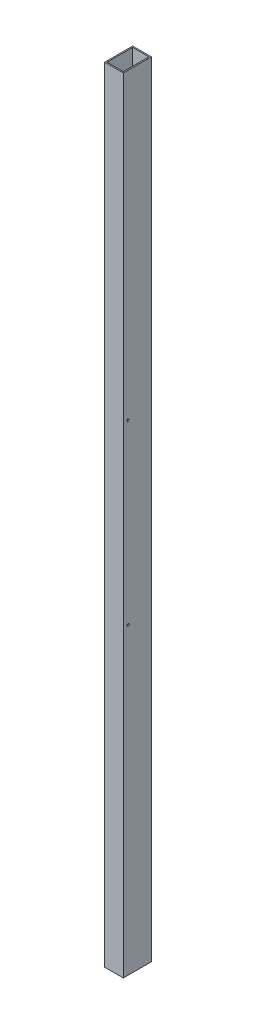
ISO-10303-21;
HEADER;
FILE_DESCRIPTION(('STEP AP214'),'2;1');
FILE_NAME('part.step','',(''),(''),'','','');
FILE_SCHEMA(('AUTOMOTIVE_DESIGN { 1 0 10303 214 1 1 1 1 }'));
ENDSEC;
DATA;
#1=APPLICATION_CONTEXT('core data for automotive mechanical design processes');
#2=APPLICATION_PROTOCOL_DEFINITION('international standard','automotive_design',2000,#1);
#3=PRODUCT_CONTEXT('',#1,'mechanical');
#4=PRODUCT('Part','Part','',(#3));
#5=PRODUCT_RELATED_PRODUCT_CATEGORY('part','',(#4));
#6=PRODUCT_DEFINITION_FORMATION('','',#4);
#7=PRODUCT_DEFINITION_CONTEXT('part definition',#1,'design');
#8=PRODUCT_DEFINITION('design','',#6,#7);
#9=PRODUCT_DEFINITION_SHAPE('','',#8);
#10=(LENGTH_UNIT() NAMED_UNIT(*) SI_UNIT(.MILLI.,.METRE.));
#11=(NAMED_UNIT(*) PLANE_ANGLE_UNIT() SI_UNIT($,.RADIAN.));
#12=(NAMED_UNIT(*) SI_UNIT($,.STERADIAN.) SOLID_ANGLE_UNIT());
#13=UNCERTAINTY_MEASURE_WITH_UNIT(LENGTH_MEASURE(1.E-05),#10,'distance_accuracy_value','');
#14=(GEOMETRIC_REPRESENTATION_CONTEXT(3) GLOBAL_UNCERTAINTY_ASSIGNED_CONTEXT((#13)) GLOBAL_UNIT_ASSIGNED_CONTEXT((#10,
#11,#12)) REPRESENTATION_CONTEXT('',''));
#15=CARTESIAN_POINT('',(0.,0.,0.));
#16=DIRECTION('',(0.,0.,1.));
#17=DIRECTION('',(1.,0.,0.));
#18=AXIS2_PLACEMENT_3D('',#15,#16,#17);
#19=CARTESIAN_POINT('',(0.,-1066.8,0.));
#20=DIRECTION('',(0.,-1.,0.));
#21=DIRECTION('',(1.,0.,0.));
#22=AXIS2_PLACEMENT_3D('',#19,#20,#21);
#23=PLANE('',#22);
#24=DIRECTION('',(0.,0.,-1.));
#25=VECTOR('',#24,1.);
#26=CARTESIAN_POINT('',(25.4,-1066.8,0.));
#27=LINE('',#26,#25);
#28=CARTESIAN_POINT('',(25.4,-1066.8,38.1));
#29=VERTEX_POINT('',#28);
#30=CARTESIAN_POINT('',(25.4,-1066.8,-38.1));
#31=VERTEX_POINT('',#30);
#32=EDGE_CURVE('E145',#29,#31,#27,.T.);
#33=ORIENTED_EDGE('',*,*,#32,.F.);
#34=DIRECTION('',(-1.,0.,0.));
#35=VECTOR('',#34,1.);
#36=CARTESIAN_POINT('',(0.,-1066.8,38.1));
#37=LINE('',#36,#35);
#38=CARTESIAN_POINT('',(-25.4,-1066.8,38.1));
#39=VERTEX_POINT('',#38);
#40=EDGE_CURVE('E149',#29,#39,#37,.T.);
#41=ORIENTED_EDGE('',*,*,#40,.T.);
#42=DIRECTION('',(0.,0.,-1.));
#43=VECTOR('',#42,1.);
#44=CARTESIAN_POINT('',(-25.4,-1066.8,0.));
#45=LINE('',#44,#43);
#46=CARTESIAN_POINT('',(-25.4,-1066.8,-38.1));
#47=VERTEX_POINT('',#46);
#48=EDGE_CURVE('E153',#39,#47,#45,.T.);
#49=ORIENTED_EDGE('',*,*,#48,.T.);
#50=DIRECTION('',(-1.,0.,0.));
#51=VECTOR('',#50,1.);
#52=CARTESIAN_POINT('',(0.,-1066.8,-38.1));
#53=LINE('',#52,#51);
#54=EDGE_CURVE('E156',#31,#47,#53,.T.);
#55=ORIENTED_EDGE('',*,*,#54,.F.);
#56=EDGE_LOOP('',(#33,#41,#49,#55));
#57=FACE_BOUND('',#56,.T.);
#58=DIRECTION('',(-1.,0.,0.));
#59=VECTOR('',#58,1.);
#60=CARTESIAN_POINT('',(0.,-1066.8,34.925));
#61=LINE('',#60,#59);
#62=CARTESIAN_POINT('',(22.225,-1066.8,34.925));
#63=VERTEX_POINT('',#62);
#64=CARTESIAN_POINT('',(-22.225,-1066.8,34.925));
#65=VERTEX_POINT('',#64);
#66=EDGE_CURVE('E132',#63,#65,#61,.T.);
#67=ORIENTED_EDGE('',*,*,#66,.F.);
#68=DIRECTION('',(0.,0.,-1.));
#69=VECTOR('',#68,1.);
#70=CARTESIAN_POINT('',(22.225,-1066.8,0.));
#71=LINE('',#70,#69);
#72=CARTESIAN_POINT('',(22.225,-1066.8,-34.925));
#73=VERTEX_POINT('',#72);
#74=EDGE_CURVE('E126',#63,#73,#71,.T.);
#75=ORIENTED_EDGE('',*,*,#74,.T.);
#76=DIRECTION('',(-1.,0.,0.));
#77=VECTOR('',#76,1.);
#78=CARTESIAN_POINT('',(0.,-1066.8,-34.925));
#79=LINE('',#78,#77);
#80=CARTESIAN_POINT('',(-22.225,-1066.8,-34.925));
#81=VERTEX_POINT('',#80);
#82=EDGE_CURVE('E107',#73,#81,#79,.T.);
#83=ORIENTED_EDGE('',*,*,#82,.T.);
#84=DIRECTION('',(0.,0.,-1.));
#85=VECTOR('',#84,1.);
#86=CARTESIAN_POINT('',(-22.225,-1066.8,0.));
#87=LINE('',#86,#85);
#88=EDGE_CURVE('E141',#65,#81,#87,.T.);
#89=ORIENTED_EDGE('',*,*,#88,.F.);
#90=EDGE_LOOP('',(#67,#75,#83,#89));
#91=FACE_BOUND('',#90,.T.);
#92=ADVANCED_FACE('F14',(#57,#91),#23,.T.);
#93=CARTESIAN_POINT('',(0.,1066.8,0.));
#94=DIRECTION('',(0.,-1.,0.));
#95=DIRECTION('',(1.,0.,0.));
#96=AXIS2_PLACEMENT_3D('',#93,#94,#95);
#97=PLANE('',#96);
#98=DIRECTION('',(0.,0.,-1.));
#99=VECTOR('',#98,1.);
#100=CARTESIAN_POINT('',(25.4,1066.8,0.));
#101=LINE('',#100,#99);
#102=CARTESIAN_POINT('',(25.4,1066.8,38.1));
#103=VERTEX_POINT('',#102);
#104=CARTESIAN_POINT('',(25.4,1066.8,-38.1));
#105=VERTEX_POINT('',#104);
#106=EDGE_CURVE('E161',#103,#105,#101,.T.);
#107=ORIENTED_EDGE('',*,*,#106,.T.);
#108=DIRECTION('',(-1.,0.,0.));
#109=VECTOR('',#108,1.);
#110=CARTESIAN_POINT('',(0.,1066.8,-38.1));
#111=LINE('',#110,#109);
#112=CARTESIAN_POINT('',(-25.4,1066.8,-38.1));
#113=VERTEX_POINT('',#112);
#114=EDGE_CURVE('E150',#105,#113,#111,.T.);
#115=ORIENTED_EDGE('',*,*,#114,.T.);
#116=DIRECTION('',(0.,0.,-1.));
#117=VECTOR('',#116,1.);
#118=CARTESIAN_POINT('',(-25.4,1066.8,0.));
#119=LINE('',#118,#117);
#120=CARTESIAN_POINT('',(-25.4,1066.8,38.1));
#121=VERTEX_POINT('',#120);
#122=EDGE_CURVE('E168',#121,#113,#119,.T.);
#123=ORIENTED_EDGE('',*,*,#122,.F.);
#124=DIRECTION('',(-1.,0.,0.));
#125=VECTOR('',#124,1.);
#126=CARTESIAN_POINT('',(0.,1066.8,38.1));
#127=LINE('',#126,#125);
#128=EDGE_CURVE('E165',#103,#121,#127,.T.);
#129=ORIENTED_EDGE('',*,*,#128,.F.);
#130=EDGE_LOOP('',(#107,#115,#123,#129));
#131=FACE_BOUND('',#130,.T.);
#132=DIRECTION('',(0.,0.,-1.));
#133=VECTOR('',#132,1.);
#134=CARTESIAN_POINT('',(22.225,1066.8,0.));
#135=LINE('',#134,#133);
#136=CARTESIAN_POINT('',(22.225,1066.8,34.925));
#137=VERTEX_POINT('',#136);
#138=CARTESIAN_POINT('',(22.225,1066.8,-34.925));
#139=VERTEX_POINT('',#138);
#140=EDGE_CURVE('E114',#137,#139,#135,.T.);
#141=ORIENTED_EDGE('',*,*,#140,.F.);
#142=DIRECTION('',(-1.,0.,0.));
#143=VECTOR('',#142,1.);
#144=CARTESIAN_POINT('',(0.,1066.8,34.925));
#145=LINE('',#144,#143);
#146=CARTESIAN_POINT('',(-22.225,1066.8,34.925));
#147=VERTEX_POINT('',#146);
#148=EDGE_CURVE('E121',#137,#147,#145,.T.);
#149=ORIENTED_EDGE('',*,*,#148,.T.);
#150=DIRECTION('',(0.,0.,-1.));
#151=VECTOR('',#150,1.);
#152=CARTESIAN_POINT('',(-22.225,1066.8,0.));
#153=LINE('',#152,#151);
#154=CARTESIAN_POINT('',(-22.225,1066.8,-34.925));
#155=VERTEX_POINT('',#154);
#156=EDGE_CURVE('E48',#147,#155,#153,.T.);
#157=ORIENTED_EDGE('',*,*,#156,.T.);
#158=DIRECTION('',(-1.,0.,0.));
#159=VECTOR('',#158,1.);
#160=CARTESIAN_POINT('',(0.,1066.8,-34.925));
#161=LINE('',#160,#159);
#162=EDGE_CURVE('E105',#139,#155,#161,.T.);
#163=ORIENTED_EDGE('',*,*,#162,.F.);
#164=EDGE_LOOP('',(#141,#149,#157,#163));
#165=FACE_BOUND('',#164,.T.);
#166=ADVANCED_FACE('F124',(#131,#165),#97,.F.);
#167=CARTESIAN_POINT('',(25.4,-1066.8,0.));
#168=DIRECTION('',(1.,0.,0.));
#169=DIRECTION('',(0.,0.,-1.));
#170=AXIS2_PLACEMENT_3D('',#167,#168,#169);
#171=PLANE('',#170);
#172=CARTESIAN_POINT('',(25.4,241.3,25.4));
#173=DIRECTION('',(1.,0.,0.));
#174=DIRECTION('',(0.,0.,-1.));
#175=AXIS2_PLACEMENT_3D('',#172,#173,#174);
#176=CIRCLE('',#175,3.3655);
#177=CARTESIAN_POINT('',(25.4,241.3,22.0345));
#178=VERTEX_POINT('',#177);
#179=EDGE_CURVE('E274',#178,#178,#176,.T.);
#180=ORIENTED_EDGE('',*,*,#179,.F.);
#181=EDGE_LOOP('',(#180));
#182=FACE_BOUND('',#181,.T.);
#183=CARTESIAN_POINT('',(25.4,-241.3,25.4));
#184=DIRECTION('',(1.,0.,0.));
#185=DIRECTION('',(0.,0.,-1.));
#186=AXIS2_PLACEMENT_3D('',#183,#184,#185);
#187=CIRCLE('',#186,3.3655);
#188=CARTESIAN_POINT('',(25.4,-241.3,22.0345));
#189=VERTEX_POINT('',#188);
#190=EDGE_CURVE('E186',#189,#189,#187,.T.);
#191=ORIENTED_EDGE('',*,*,#190,.F.);
#192=EDGE_LOOP('',(#191));
#193=FACE_BOUND('',#192,.T.);
#194=ORIENTED_EDGE('',*,*,#106,.F.);
#195=DIRECTION('',(0.,1.,0.));
#196=VECTOR('',#195,1.);
#197=CARTESIAN_POINT('',(25.4,-1066.8,38.1));
#198=LINE('',#197,#196);
#199=EDGE_CURVE('E9',#29,#103,#198,.T.);
#200=ORIENTED_EDGE('',*,*,#199,.F.);
#201=ORIENTED_EDGE('',*,*,#32,.T.);
#202=DIRECTION('',(0.,1.,0.));
#203=VECTOR('',#202,1.);
#204=CARTESIAN_POINT('',(25.4,-1066.8,-38.1));
#205=LINE('',#204,#203);
#206=EDGE_CURVE('E160',#31,#105,#205,.T.);
#207=ORIENTED_EDGE('',*,*,#206,.T.);
#208=EDGE_LOOP('',(#194,#200,#201,#207));
#209=FACE_BOUND('',#208,.T.);
#210=ADVANCED_FACE('F16',(#182,#193,#209),#171,.T.);
#211=CARTESIAN_POINT('',(0.,-1066.8,38.1));
#212=DIRECTION('',(0.,0.,-1.));
#213=DIRECTION('',(-1.,0.,0.));
#214=AXIS2_PLACEMENT_3D('',#211,#212,#213);
#215=PLANE('',#214);
#216=ORIENTED_EDGE('',*,*,#128,.T.);
#217=DIRECTION('',(0.,1.,0.));
#218=VECTOR('',#217,1.);
#219=CARTESIAN_POINT('',(-25.4,-1066.8,38.1));
#220=LINE('',#219,#218);
#221=EDGE_CURVE('E24',#39,#121,#220,.T.);
#222=ORIENTED_EDGE('',*,*,#221,.F.);
#223=ORIENTED_EDGE('',*,*,#40,.F.);
#224=ORIENTED_EDGE('',*,*,#199,.T.);
#225=EDGE_LOOP('',(#216,#222,#223,#224));
#226=FACE_BOUND('',#225,.T.);
#227=ADVANCED_FACE('F250',(#226),#215,.F.);
#228=CARTESIAN_POINT('',(-25.4,-1066.8,0.));
#229=DIRECTION('',(1.,0.,0.));
#230=DIRECTION('',(0.,0.,-1.));
#231=AXIS2_PLACEMENT_3D('',#228,#229,#230);
#232=PLANE('',#231);
#233=CARTESIAN_POINT('',(-25.4,241.3,25.4));
#234=DIRECTION('',(1.,0.,0.));
#235=DIRECTION('',(0.,0.,-1.));
#236=AXIS2_PLACEMENT_3D('',#233,#234,#235);
#237=CIRCLE('',#236,3.3655);
#238=CARTESIAN_POINT('',(-25.4,241.3,22.0345));
#239=VERTEX_POINT('',#238);
#240=EDGE_CURVE('E196',#239,#239,#237,.F.);
#241=ORIENTED_EDGE('',*,*,#240,.F.);
#242=EDGE_LOOP('',(#241));
#243=FACE_BOUND('',#242,.T.);
#244=CARTESIAN_POINT('',(-25.4,-241.3,25.4));
#245=DIRECTION('',(1.,0.,0.));
#246=DIRECTION('',(0.,0.,-1.));
#247=AXIS2_PLACEMENT_3D('',#244,#245,#246);
#248=CIRCLE('',#247,3.3655);
#249=CARTESIAN_POINT('',(-25.4,-241.3,22.0345));
#250=VERTEX_POINT('',#249);
#251=EDGE_CURVE('E122',#250,#250,#248,.F.);
#252=ORIENTED_EDGE('',*,*,#251,.F.);
#253=EDGE_LOOP('',(#252));
#254=FACE_BOUND('',#253,.T.);
#255=ORIENTED_EDGE('',*,*,#122,.T.);
#256=DIRECTION('',(0.,1.,0.));
#257=VECTOR('',#256,1.);
#258=CARTESIAN_POINT('',(-25.4,-1066.8,-38.1));
#259=LINE('',#258,#257);
#260=EDGE_CURVE('E177',#47,#113,#259,.T.);
#261=ORIENTED_EDGE('',*,*,#260,.F.);
#262=ORIENTED_EDGE('',*,*,#48,.F.);
#263=ORIENTED_EDGE('',*,*,#221,.T.);
#264=EDGE_LOOP('',(#255,#261,#262,#263));
#265=FACE_BOUND('',#264,.T.);
#266=ADVANCED_FACE('F247',(#243,#254,#265),#232,.F.);
#267=CARTESIAN_POINT('',(0.,-1066.8,-38.1));
#268=DIRECTION('',(0.,0.,-1.));
#269=DIRECTION('',(-1.,0.,0.));
#270=AXIS2_PLACEMENT_3D('',#267,#268,#269);
#271=PLANE('',#270);
#272=ORIENTED_EDGE('',*,*,#114,.F.);
#273=ORIENTED_EDGE('',*,*,#206,.F.);
#274=ORIENTED_EDGE('',*,*,#54,.T.);
#275=ORIENTED_EDGE('',*,*,#260,.T.);
#276=EDGE_LOOP('',(#272,#273,#274,#275));
#277=FACE_BOUND('',#276,.T.);
#278=ADVANCED_FACE('F231',(#277),#271,.T.);
#279=CARTESIAN_POINT('',(22.225,-1066.8,0.));
#280=DIRECTION('',(1.,0.,0.));
#281=DIRECTION('',(0.,0.,-1.));
#282=AXIS2_PLACEMENT_3D('',#279,#280,#281);
#283=PLANE('',#282);
#284=CARTESIAN_POINT('',(22.225,241.3,25.4));
#285=DIRECTION('',(1.,0.,0.));
#286=DIRECTION('',(0.,0.,-1.));
#287=AXIS2_PLACEMENT_3D('',#284,#285,#286);
#288=CIRCLE('',#287,3.3655);
#289=CARTESIAN_POINT('',(22.225,241.3,22.0345));
#290=VERTEX_POINT('',#289);
#291=EDGE_CURVE('E205',#290,#290,#288,.F.);
#292=ORIENTED_EDGE('',*,*,#291,.F.);
#293=EDGE_LOOP('',(#292));
#294=FACE_BOUND('',#293,.T.);
#295=CARTESIAN_POINT('',(22.225,-241.3,25.4));
#296=DIRECTION('',(1.,0.,0.));
#297=DIRECTION('',(0.,0.,-1.));
#298=AXIS2_PLACEMENT_3D('',#295,#296,#297);
#299=CIRCLE('',#298,3.3655);
#300=CARTESIAN_POINT('',(22.225,-241.3,22.0345));
#301=VERTEX_POINT('',#300);
#302=EDGE_CURVE('E185',#301,#301,#299,.F.);
#303=ORIENTED_EDGE('',*,*,#302,.F.);
#304=EDGE_LOOP('',(#303));
#305=FACE_BOUND('',#304,.T.);
#306=ORIENTED_EDGE('',*,*,#140,.T.);
#307=DIRECTION('',(0.,1.,0.));
#308=VECTOR('',#307,1.);
#309=CARTESIAN_POINT('',(22.225,-1066.8,-34.925));
#310=LINE('',#309,#308);
#311=EDGE_CURVE('E101',#73,#139,#310,.T.);
#312=ORIENTED_EDGE('',*,*,#311,.F.);
#313=ORIENTED_EDGE('',*,*,#74,.F.);
#314=DIRECTION('',(0.,1.,0.));
#315=VECTOR('',#314,1.);
#316=CARTESIAN_POINT('',(22.225,-1066.8,34.925));
#317=LINE('',#316,#315);
#318=EDGE_CURVE('E116',#63,#137,#317,.T.);
#319=ORIENTED_EDGE('',*,*,#318,.T.);
#320=EDGE_LOOP('',(#306,#312,#313,#319));
#321=FACE_BOUND('',#320,.T.);
#322=ADVANCED_FACE('F115',(#294,#305,#321),#283,.F.);
#323=CARTESIAN_POINT('',(0.,-1066.8,34.925));
#324=DIRECTION('',(0.,0.,-1.));
#325=DIRECTION('',(-1.,0.,0.));
#326=AXIS2_PLACEMENT_3D('',#323,#324,#325);
#327=PLANE('',#326);
#328=ORIENTED_EDGE('',*,*,#148,.F.);
#329=ORIENTED_EDGE('',*,*,#318,.F.);
#330=ORIENTED_EDGE('',*,*,#66,.T.);
#331=DIRECTION('',(0.,1.,0.));
#332=VECTOR('',#331,1.);
#333=CARTESIAN_POINT('',(-22.225,-1066.8,34.925));
#334=LINE('',#333,#332);
#335=EDGE_CURVE('E211',#65,#147,#334,.T.);
#336=ORIENTED_EDGE('',*,*,#335,.T.);
#337=EDGE_LOOP('',(#328,#329,#330,#336));
#338=FACE_BOUND('',#337,.T.);
#339=ADVANCED_FACE('F221',(#338),#327,.T.);
#340=CARTESIAN_POINT('',(-22.225,-1066.8,0.));
#341=DIRECTION('',(1.,0.,0.));
#342=DIRECTION('',(0.,0.,-1.));
#343=AXIS2_PLACEMENT_3D('',#340,#341,#342);
#344=PLANE('',#343);
#345=CARTESIAN_POINT('',(-22.225,241.3,25.4));
#346=DIRECTION('',(1.,0.,0.));
#347=DIRECTION('',(0.,0.,-1.));
#348=AXIS2_PLACEMENT_3D('',#345,#346,#347);
#349=CIRCLE('',#348,3.3655);
#350=CARTESIAN_POINT('',(-22.225,241.3,22.0345));
#351=VERTEX_POINT('',#350);
#352=EDGE_CURVE('E18',#351,#351,#349,.F.);
#353=ORIENTED_EDGE('',*,*,#352,.T.);
#354=EDGE_LOOP('',(#353));
#355=FACE_BOUND('',#354,.T.);
#356=CARTESIAN_POINT('',(-22.225,-241.3,25.4));
#357=DIRECTION('',(1.,0.,0.));
#358=DIRECTION('',(0.,0.,-1.));
#359=AXIS2_PLACEMENT_3D('',#356,#357,#358);
#360=CIRCLE('',#359,3.3655);
#361=CARTESIAN_POINT('',(-22.225,-241.3,22.0345));
#362=VERTEX_POINT('',#361);
#363=EDGE_CURVE('E182',#362,#362,#360,.F.);
#364=ORIENTED_EDGE('',*,*,#363,.T.);
#365=EDGE_LOOP('',(#364));
#366=FACE_BOUND('',#365,.T.);
#367=ORIENTED_EDGE('',*,*,#156,.F.);
#368=ORIENTED_EDGE('',*,*,#335,.F.);
#369=ORIENTED_EDGE('',*,*,#88,.T.);
#370=DIRECTION('',(0.,1.,0.));
#371=VECTOR('',#370,1.);
#372=CARTESIAN_POINT('',(-22.225,-1066.8,-34.925));
#373=LINE('',#372,#371);
#374=EDGE_CURVE('E37',#81,#155,#373,.T.);
#375=ORIENTED_EDGE('',*,*,#374,.T.);
#376=EDGE_LOOP('',(#367,#368,#369,#375));
#377=FACE_BOUND('',#376,.T.);
#378=ADVANCED_FACE('F216',(#355,#366,#377),#344,.T.);
#379=CARTESIAN_POINT('',(0.,-1066.8,-34.925));
#380=DIRECTION('',(0.,0.,-1.));
#381=DIRECTION('',(-1.,0.,0.));
#382=AXIS2_PLACEMENT_3D('',#379,#380,#381);
#383=PLANE('',#382);
#384=ORIENTED_EDGE('',*,*,#162,.T.);
#385=ORIENTED_EDGE('',*,*,#374,.F.);
#386=ORIENTED_EDGE('',*,*,#82,.F.);
#387=ORIENTED_EDGE('',*,*,#311,.T.);
#388=EDGE_LOOP('',(#384,#385,#386,#387));
#389=FACE_BOUND('',#388,.T.);
#390=ADVANCED_FACE('F103',(#389),#383,.F.);
#391=CARTESIAN_POINT('',(-2111.17566993004,-241.3,25.4));
#392=DIRECTION('',(1.,0.,0.));
#393=DIRECTION('',(0.,0.,-1.));
#394=AXIS2_PLACEMENT_3D('',#391,#392,#393);
#395=CYLINDRICAL_SURFACE('',#394,3.3655);
#396=ORIENTED_EDGE('',*,*,#363,.F.);
#397=EDGE_LOOP('',(#396));
#398=FACE_BOUND('',#397,.T.);
#399=ORIENTED_EDGE('',*,*,#251,.T.);
#400=EDGE_LOOP('',(#399));
#401=FACE_BOUND('',#400,.T.);
#402=ADVANCED_FACE('F295',(#398,#401),#395,.F.);
#403=ORIENTED_EDGE('',*,*,#190,.T.);
#404=EDGE_LOOP('',(#403));
#405=FACE_BOUND('',#404,.T.);
#406=ORIENTED_EDGE('',*,*,#302,.T.);
#407=EDGE_LOOP('',(#406));
#408=FACE_BOUND('',#407,.T.);
#409=ADVANCED_FACE('F292',(#405,#408),#395,.F.);
#410=CARTESIAN_POINT('',(-2111.17566993004,241.3,25.4));
#411=DIRECTION('',(1.,0.,0.));
#412=DIRECTION('',(0.,0.,-1.));
#413=AXIS2_PLACEMENT_3D('',#410,#411,#412);
#414=CYLINDRICAL_SURFACE('',#413,3.3655);
#415=ORIENTED_EDGE('',*,*,#352,.F.);
#416=EDGE_LOOP('',(#415));
#417=FACE_BOUND('',#416,.T.);
#418=ORIENTED_EDGE('',*,*,#240,.T.);
#419=EDGE_LOOP('',(#418));
#420=FACE_BOUND('',#419,.T.);
#421=ADVANCED_FACE('F294',(#417,#420),#414,.F.);
#422=ORIENTED_EDGE('',*,*,#179,.T.);
#423=EDGE_LOOP('',(#422));
#424=FACE_BOUND('',#423,.T.);
#425=ORIENTED_EDGE('',*,*,#291,.T.);
#426=EDGE_LOOP('',(#425));
#427=FACE_BOUND('',#426,.T.);
#428=ADVANCED_FACE('F288',(#424,#427),#414,.F.);
#429=CLOSED_SHELL('',(#92,#166,#210,#227,#266,#278,#322,#339,#378,#390,#402,#409,#421,#428));
#430=MANIFOLD_SOLID_BREP('B1',#429);
#431=ADVANCED_BREP_SHAPE_REPRESENTATION('',(#18,#430),#14);
#432=SHAPE_DEFINITION_REPRESENTATION(#9,#431);
ENDSEC;
END-ISO-10303-21;
